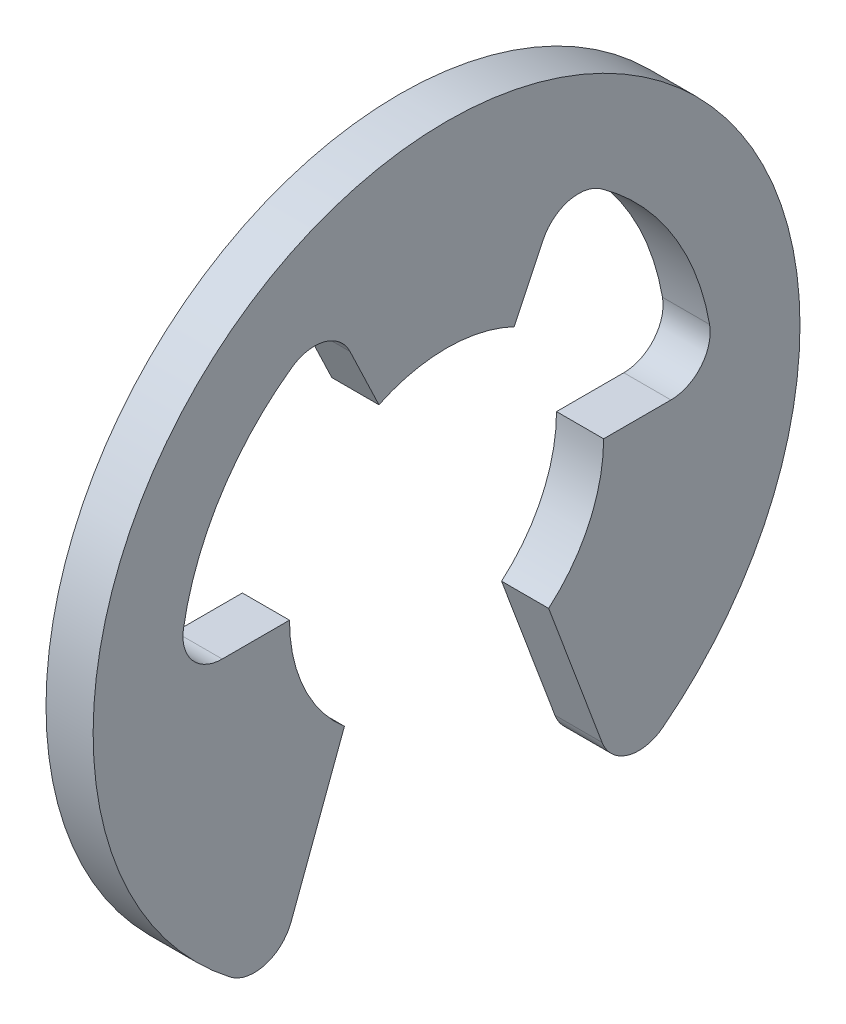
ISO-10303-21;
HEADER;
FILE_DESCRIPTION(('STEP AP214'),'2;1');
FILE_NAME('part.step','',(''),(''),'','','');
FILE_SCHEMA(('AUTOMOTIVE_DESIGN { 1 0 10303 214 1 1 1 1 }'));
ENDSEC;
DATA;
#1=APPLICATION_CONTEXT('core data for automotive mechanical design processes');
#2=APPLICATION_PROTOCOL_DEFINITION('international standard','automotive_design',2000,#1);
#3=PRODUCT_CONTEXT('',#1,'mechanical');
#4=PRODUCT('Part','Part','',(#3));
#5=PRODUCT_RELATED_PRODUCT_CATEGORY('part','',(#4));
#6=PRODUCT_DEFINITION_FORMATION('','',#4);
#7=PRODUCT_DEFINITION_CONTEXT('part definition',#1,'design');
#8=PRODUCT_DEFINITION('design','',#6,#7);
#9=PRODUCT_DEFINITION_SHAPE('','',#8);
#10=(LENGTH_UNIT() NAMED_UNIT(*) SI_UNIT(.MILLI.,.METRE.));
#11=(NAMED_UNIT(*) PLANE_ANGLE_UNIT() SI_UNIT($,.RADIAN.));
#12=(NAMED_UNIT(*) SI_UNIT($,.STERADIAN.) SOLID_ANGLE_UNIT());
#13=UNCERTAINTY_MEASURE_WITH_UNIT(LENGTH_MEASURE(1.E-05),#10,'distance_accuracy_value','');
#14=(GEOMETRIC_REPRESENTATION_CONTEXT(3) GLOBAL_UNCERTAINTY_ASSIGNED_CONTEXT((#13)) GLOBAL_UNIT_ASSIGNED_CONTEXT((#10,
#11,#12)) REPRESENTATION_CONTEXT('',''));
#15=CARTESIAN_POINT('',(0.,0.,0.));
#16=DIRECTION('',(0.,0.,1.));
#17=DIRECTION('',(1.,0.,0.));
#18=AXIS2_PLACEMENT_3D('',#15,#16,#17);
#19=CARTESIAN_POINT('',(0.6,0.500000000000001,-2.85657137141714));
#20=DIRECTION('',(-1.,0.,0.));
#21=DIRECTION('',(0.,0.,1.));
#22=AXIS2_PLACEMENT_3D('',#19,#20,#21);
#23=CYLINDRICAL_SURFACE('',#22,0.5);
#24=CARTESIAN_POINT('',(0.,0.500000000000001,-2.85657137141714));
#25=DIRECTION('',(-1.,0.,0.));
#26=DIRECTION('',(0.,0.,-1.));
#27=AXIS2_PLACEMENT_3D('',#24,#25,#26);
#28=CIRCLE('',#27,0.5);
#29=CARTESIAN_POINT('',(0.,0.586206896551725,-3.34908367683389));
#30=VERTEX_POINT('',#29);
#31=CARTESIAN_POINT('',(0.,0.,-2.85657137141714));
#32=VERTEX_POINT('',#31);
#33=EDGE_CURVE('E195',#30,#32,#28,.T.);
#34=ORIENTED_EDGE('',*,*,#33,.T.);
#35=DIRECTION('',(-1.,0.,0.));
#36=VECTOR('',#35,1.);
#37=CARTESIAN_POINT('',(0.6,0.,-2.85657137141714));
#38=LINE('',#37,#36);
#39=CARTESIAN_POINT('',(0.6,0.,-2.85657137141714));
#40=VERTEX_POINT('',#39);
#41=EDGE_CURVE('E11',#40,#32,#38,.T.);
#42=ORIENTED_EDGE('',*,*,#41,.F.);
#43=CARTESIAN_POINT('',(0.6,0.500000000000001,-2.85657137141714));
#44=DIRECTION('',(-1.,0.,0.));
#45=DIRECTION('',(0.,0.,-1.));
#46=AXIS2_PLACEMENT_3D('',#43,#44,#45);
#47=CIRCLE('',#46,0.5);
#48=CARTESIAN_POINT('',(0.6,0.586206896551725,-3.34908367683389));
#49=VERTEX_POINT('',#48);
#50=EDGE_CURVE('E229',#49,#40,#47,.T.);
#51=ORIENTED_EDGE('',*,*,#50,.F.);
#52=DIRECTION('',(-1.,0.,0.));
#53=VECTOR('',#52,1.);
#54=CARTESIAN_POINT('',(0.6,0.586206896551725,-3.34908367683389));
#55=LINE('',#54,#53);
#56=EDGE_CURVE('E191',#49,#30,#55,.T.);
#57=ORIENTED_EDGE('',*,*,#56,.T.);
#58=EDGE_LOOP('',(#34,#42,#51,#57));
#59=FACE_BOUND('',#58,.T.);
#60=ADVANCED_FACE('F39',(#59),#23,.F.);
#61=CARTESIAN_POINT('',(0.6,0.,-2.85657137141714));
#62=DIRECTION('',(0.,-1.,0.));
#63=DIRECTION('',(0.,0.,-1.));
#64=AXIS2_PLACEMENT_3D('',#61,#62,#63);
#65=PLANE('',#64);
#66=DIRECTION('',(0.,0.,1.));
#67=VECTOR('',#66,1.);
#68=CARTESIAN_POINT('',(0.,0.,-2.85657137141714));
#69=LINE('',#68,#67);
#70=CARTESIAN_POINT('',(0.,0.,-2.));
#71=VERTEX_POINT('',#70);
#72=EDGE_CURVE('E198',#32,#71,#69,.T.);
#73=ORIENTED_EDGE('',*,*,#72,.T.);
#74=DIRECTION('',(-1.,0.,0.));
#75=VECTOR('',#74,1.);
#76=CARTESIAN_POINT('',(0.6,0.,-2.));
#77=LINE('',#76,#75);
#78=CARTESIAN_POINT('',(0.6,0.,-2.));
#79=VERTEX_POINT('',#78);
#80=EDGE_CURVE('E47',#79,#71,#77,.T.);
#81=ORIENTED_EDGE('',*,*,#80,.F.);
#82=DIRECTION('',(0.,0.,1.));
#83=VECTOR('',#82,1.);
#84=CARTESIAN_POINT('',(0.6,0.,-2.85657137141714));
#85=LINE('',#84,#83);
#86=EDGE_CURVE('E128',#40,#79,#85,.T.);
#87=ORIENTED_EDGE('',*,*,#86,.F.);
#88=ORIENTED_EDGE('',*,*,#41,.T.);
#89=EDGE_LOOP('',(#73,#81,#87,#88));
#90=FACE_BOUND('',#89,.T.);
#91=ADVANCED_FACE('F337',(#90),#65,.F.);
#92=CARTESIAN_POINT('',(0.6,0.,0.));
#93=DIRECTION('',(-1.,0.,0.));
#94=DIRECTION('',(0.,0.,1.));
#95=AXIS2_PLACEMENT_3D('',#92,#93,#94);
#96=CYLINDRICAL_SURFACE('',#95,2.);
#97=CARTESIAN_POINT('',(0.,0.,0.));
#98=DIRECTION('',(-1.,0.,0.));
#99=DIRECTION('',(0.,0.,-1.));
#100=AXIS2_PLACEMENT_3D('',#97,#98,#99);
#101=CIRCLE('',#100,2.);
#102=CARTESIAN_POINT('',(0.,-1.51986841535707,-1.3));
#103=VERTEX_POINT('',#102);
#104=EDGE_CURVE('E200',#71,#103,#101,.T.);
#105=ORIENTED_EDGE('',*,*,#104,.T.);
#106=DIRECTION('',(-1.,0.,0.));
#107=VECTOR('',#106,1.);
#108=CARTESIAN_POINT('',(0.6,-1.51986841535707,-1.3));
#109=LINE('',#108,#107);
#110=CARTESIAN_POINT('',(0.6,-1.51986841535707,-1.3));
#111=VERTEX_POINT('',#110);
#112=EDGE_CURVE('E266',#111,#103,#109,.T.);
#113=ORIENTED_EDGE('',*,*,#112,.F.);
#114=CARTESIAN_POINT('',(0.6,0.,0.));
#115=DIRECTION('',(-1.,0.,0.));
#116=DIRECTION('',(0.,0.,-1.));
#117=AXIS2_PLACEMENT_3D('',#114,#115,#116);
#118=CIRCLE('',#117,2.);
#119=EDGE_CURVE('E274',#79,#111,#118,.T.);
#120=ORIENTED_EDGE('',*,*,#119,.F.);
#121=ORIENTED_EDGE('',*,*,#80,.T.);
#122=EDGE_LOOP('',(#105,#113,#120,#121));
#123=FACE_BOUND('',#122,.T.);
#124=ADVANCED_FACE('F272',(#123),#96,.F.);
#125=CARTESIAN_POINT('',(0.6,-1.51986841535707,-1.3));
#126=DIRECTION('',(0.,0.350207381259467,-0.936672189248398));
#127=DIRECTION('',(0.,0.936672189248398,0.350207381259467));
#128=AXIS2_PLACEMENT_3D('',#125,#126,#127);
#129=PLANE('',#128);
#130=DIRECTION('',(0.,-0.936672189248398,-0.350207381259466));
#131=VECTOR('',#130,1.);
#132=CARTESIAN_POINT('',(0.,-1.51986841535707,-1.3));
#133=LINE('',#132,#131);
#134=CARTESIAN_POINT('',(0.,-3.33835012725396,-1.97990245200155));
#135=VERTEX_POINT('',#134);
#136=EDGE_CURVE('E202',#103,#135,#133,.T.);
#137=ORIENTED_EDGE('',*,*,#136,.T.);
#138=DIRECTION('',(-1.,0.,0.));
#139=VECTOR('',#138,1.);
#140=CARTESIAN_POINT('',(0.6,-3.33835012725396,-1.97990245200155));
#141=LINE('',#140,#139);
#142=CARTESIAN_POINT('',(0.6,-3.33835012725396,-1.97990245200155));
#143=VERTEX_POINT('',#142);
#144=EDGE_CURVE('E263',#143,#135,#141,.T.);
#145=ORIENTED_EDGE('',*,*,#144,.F.);
#146=DIRECTION('',(0.,-0.936672189248398,-0.350207381259466));
#147=VECTOR('',#146,1.);
#148=CARTESIAN_POINT('',(0.6,-1.51986841535707,-1.3));
#149=LINE('',#148,#147);
#150=EDGE_CURVE('E292',#111,#143,#149,.T.);
#151=ORIENTED_EDGE('',*,*,#150,.F.);
#152=ORIENTED_EDGE('',*,*,#112,.T.);
#153=EDGE_LOOP('',(#137,#145,#151,#152));
#154=FACE_BOUND('',#153,.T.);
#155=ADVANCED_FACE('F283',(#154),#129,.F.);
#156=CARTESIAN_POINT('',(0.6,-3.16324643662422,-2.44823854662575));
#157=DIRECTION('',(-1.,0.,0.));
#158=DIRECTION('',(0.,0.,1.));
#159=AXIS2_PLACEMENT_3D('',#156,#157,#158);
#160=CYLINDRICAL_SURFACE('',#159,0.500000000000001);
#161=CARTESIAN_POINT('',(0.,-3.16324643662422,-2.44823854662575));
#162=DIRECTION('',(1.,0.,0.));
#163=DIRECTION('',(0.,0.,-1.));
#164=AXIS2_PLACEMENT_3D('',#161,#162,#163);
#165=CIRCLE('',#164,0.500000000000001);
#166=CARTESIAN_POINT('',(0.,-3.55865224120225,-2.75426836495397));
#167=VERTEX_POINT('',#166);
#168=EDGE_CURVE('E204',#135,#167,#165,.T.);
#169=ORIENTED_EDGE('',*,*,#168,.T.);
#170=DIRECTION('',(-1.,0.,0.));
#171=VECTOR('',#170,1.);
#172=CARTESIAN_POINT('',(0.6,-3.55865224120225,-2.75426836495397));
#173=LINE('',#172,#171);
#174=CARTESIAN_POINT('',(0.6,-3.55865224120225,-2.75426836495397));
#175=VERTEX_POINT('',#174);
#176=EDGE_CURVE('E260',#175,#167,#173,.T.);
#177=ORIENTED_EDGE('',*,*,#176,.F.);
#178=CARTESIAN_POINT('',(0.6,-3.16324643662422,-2.44823854662575));
#179=DIRECTION('',(1.,0.,0.));
#180=DIRECTION('',(0.,0.,-1.));
#181=AXIS2_PLACEMENT_3D('',#178,#179,#180);
#182=CIRCLE('',#181,0.500000000000001);
#183=EDGE_CURVE('E289',#143,#175,#182,.T.);
#184=ORIENTED_EDGE('',*,*,#183,.F.);
#185=ORIENTED_EDGE('',*,*,#144,.T.);
#186=EDGE_LOOP('',(#169,#177,#184,#185));
#187=FACE_BOUND('',#186,.T.);
#188=ADVANCED_FACE('F287',(#187),#160,.T.);
#189=CARTESIAN_POINT('',(0.6,0.,0.));
#190=DIRECTION('',(-1.,0.,0.));
#191=DIRECTION('',(0.,0.,1.));
#192=AXIS2_PLACEMENT_3D('',#189,#190,#191);
#193=CYLINDRICAL_SURFACE('',#192,4.5);
#194=CARTESIAN_POINT('',(0.,0.,0.));
#195=DIRECTION('',(1.,0.,0.));
#196=DIRECTION('',(0.,0.,-1.));
#197=AXIS2_PLACEMENT_3D('',#194,#195,#196);
#198=CIRCLE('',#197,4.5);
#199=CARTESIAN_POINT('',(0.,-3.55865224120225,2.75426836495396));
#200=VERTEX_POINT('',#199);
#201=EDGE_CURVE('E206',#167,#200,#198,.T.);
#202=ORIENTED_EDGE('',*,*,#201,.T.);
#203=DIRECTION('',(-1.,0.,0.));
#204=VECTOR('',#203,1.);
#205=CARTESIAN_POINT('',(0.6,-3.55865224120225,2.75426836495396));
#206=LINE('',#205,#204);
#207=CARTESIAN_POINT('',(0.6,-3.55865224120225,2.75426836495396));
#208=VERTEX_POINT('',#207);
#209=EDGE_CURVE('E257',#208,#200,#206,.T.);
#210=ORIENTED_EDGE('',*,*,#209,.F.);
#211=CARTESIAN_POINT('',(0.6,0.,0.));
#212=DIRECTION('',(1.,0.,0.));
#213=DIRECTION('',(0.,0.,-1.));
#214=AXIS2_PLACEMENT_3D('',#211,#212,#213);
#215=CIRCLE('',#214,4.5);
#216=EDGE_CURVE('E291',#175,#208,#215,.T.);
#217=ORIENTED_EDGE('',*,*,#216,.F.);
#218=ORIENTED_EDGE('',*,*,#176,.T.);
#219=EDGE_LOOP('',(#202,#210,#217,#218));
#220=FACE_BOUND('',#219,.T.);
#221=ADVANCED_FACE('F350',(#220),#193,.T.);
#222=CARTESIAN_POINT('',(0.6,-3.16324643662422,2.44823854662575));
#223=DIRECTION('',(-1.,0.,0.));
#224=DIRECTION('',(0.,0.,1.));
#225=AXIS2_PLACEMENT_3D('',#222,#223,#224);
#226=CYLINDRICAL_SURFACE('',#225,0.5);
#227=CARTESIAN_POINT('',(0.,-3.16324643662422,2.44823854662575));
#228=DIRECTION('',(1.,0.,0.));
#229=DIRECTION('',(0.,0.,-1.));
#230=AXIS2_PLACEMENT_3D('',#227,#228,#229);
#231=CIRCLE('',#230,0.5);
#232=CARTESIAN_POINT('',(0.,-3.33835012725396,1.97990245200155));
#233=VERTEX_POINT('',#232);
#234=EDGE_CURVE('E208',#200,#233,#231,.T.);
#235=ORIENTED_EDGE('',*,*,#234,.T.);
#236=DIRECTION('',(-1.,0.,0.));
#237=VECTOR('',#236,1.);
#238=CARTESIAN_POINT('',(0.6,-3.33835012725396,1.97990245200155));
#239=LINE('',#238,#237);
#240=CARTESIAN_POINT('',(0.6,-3.33835012725396,1.97990245200155));
#241=VERTEX_POINT('',#240);
#242=EDGE_CURVE('E254',#241,#233,#239,.T.);
#243=ORIENTED_EDGE('',*,*,#242,.F.);
#244=CARTESIAN_POINT('',(0.6,-3.16324643662422,2.44823854662575));
#245=DIRECTION('',(1.,0.,0.));
#246=DIRECTION('',(0.,0.,-1.));
#247=AXIS2_PLACEMENT_3D('',#244,#245,#246);
#248=CIRCLE('',#247,0.5);
#249=EDGE_CURVE('E294',#208,#241,#248,.T.);
#250=ORIENTED_EDGE('',*,*,#249,.F.);
#251=ORIENTED_EDGE('',*,*,#209,.T.);
#252=EDGE_LOOP('',(#235,#243,#250,#251));
#253=FACE_BOUND('',#252,.T.);
#254=ADVANCED_FACE('F353',(#253),#226,.T.);
#255=CARTESIAN_POINT('',(0.6,-3.33835012725396,1.97990245200155));
#256=DIRECTION('',(0.,0.350207381259465,0.936672189248399));
#257=DIRECTION('',(0.,-0.936672189248399,0.350207381259465));
#258=AXIS2_PLACEMENT_3D('',#255,#256,#257);
#259=PLANE('',#258);
#260=DIRECTION('',(0.,0.936672189248398,-0.350207381259465));
#261=VECTOR('',#260,1.);
#262=CARTESIAN_POINT('',(0.,-3.33835012725396,1.97990245200155));
#263=LINE('',#262,#261);
#264=CARTESIAN_POINT('',(0.,-1.51986841535706,1.3));
#265=VERTEX_POINT('',#264);
#266=EDGE_CURVE('E210',#233,#265,#263,.T.);
#267=ORIENTED_EDGE('',*,*,#266,.T.);
#268=DIRECTION('',(-1.,0.,0.));
#269=VECTOR('',#268,1.);
#270=CARTESIAN_POINT('',(0.6,-1.51986841535706,1.3));
#271=LINE('',#270,#269);
#272=CARTESIAN_POINT('',(0.6,-1.51986841535706,1.3));
#273=VERTEX_POINT('',#272);
#274=EDGE_CURVE('E251',#273,#265,#271,.T.);
#275=ORIENTED_EDGE('',*,*,#274,.F.);
#276=DIRECTION('',(0.,0.936672189248398,-0.350207381259465));
#277=VECTOR('',#276,1.);
#278=CARTESIAN_POINT('',(0.6,-3.33835012725396,1.97990245200155));
#279=LINE('',#278,#277);
#280=EDGE_CURVE('E300',#241,#273,#279,.T.);
#281=ORIENTED_EDGE('',*,*,#280,.F.);
#282=ORIENTED_EDGE('',*,*,#242,.T.);
#283=EDGE_LOOP('',(#267,#275,#281,#282));
#284=FACE_BOUND('',#283,.T.);
#285=ADVANCED_FACE('F357',(#284),#259,.F.);
#286=CARTESIAN_POINT('',(0.6,0.,0.));
#287=DIRECTION('',(-1.,0.,0.));
#288=DIRECTION('',(0.,0.,1.));
#289=AXIS2_PLACEMENT_3D('',#286,#287,#288);
#290=CYLINDRICAL_SURFACE('',#289,2.);
#291=CARTESIAN_POINT('',(0.,0.,0.));
#292=DIRECTION('',(-1.,0.,0.));
#293=DIRECTION('',(0.,0.,-1.));
#294=AXIS2_PLACEMENT_3D('',#291,#292,#293);
#295=CIRCLE('',#294,2.);
#296=CARTESIAN_POINT('',(0.,0.,2.));
#297=VERTEX_POINT('',#296);
#298=EDGE_CURVE('E212',#265,#297,#295,.T.);
#299=ORIENTED_EDGE('',*,*,#298,.T.);
#300=DIRECTION('',(-1.,0.,0.));
#301=VECTOR('',#300,1.);
#302=CARTESIAN_POINT('',(0.6,0.,2.));
#303=LINE('',#302,#301);
#304=CARTESIAN_POINT('',(0.6,0.,2.));
#305=VERTEX_POINT('',#304);
#306=EDGE_CURVE('E248',#305,#297,#303,.T.);
#307=ORIENTED_EDGE('',*,*,#306,.F.);
#308=CARTESIAN_POINT('',(0.6,0.,0.));
#309=DIRECTION('',(-1.,0.,0.));
#310=DIRECTION('',(0.,0.,-1.));
#311=AXIS2_PLACEMENT_3D('',#308,#309,#310);
#312=CIRCLE('',#311,2.);
#313=EDGE_CURVE('E302',#273,#305,#312,.T.);
#314=ORIENTED_EDGE('',*,*,#313,.F.);
#315=ORIENTED_EDGE('',*,*,#274,.T.);
#316=EDGE_LOOP('',(#299,#307,#314,#315));
#317=FACE_BOUND('',#316,.T.);
#318=ADVANCED_FACE('F361',(#317),#290,.F.);
#319=CARTESIAN_POINT('',(0.6,0.,2.));
#320=DIRECTION('',(0.,-1.,0.));
#321=DIRECTION('',(0.,0.,-1.));
#322=AXIS2_PLACEMENT_3D('',#319,#320,#321);
#323=PLANE('',#322);
#324=DIRECTION('',(0.,0.,1.));
#325=VECTOR('',#324,1.);
#326=CARTESIAN_POINT('',(0.,0.,2.));
#327=LINE('',#326,#325);
#328=CARTESIAN_POINT('',(0.,0.,2.85657137141714));
#329=VERTEX_POINT('',#328);
#330=EDGE_CURVE('E214',#297,#329,#327,.T.);
#331=ORIENTED_EDGE('',*,*,#330,.T.);
#332=DIRECTION('',(-1.,0.,0.));
#333=VECTOR('',#332,1.);
#334=CARTESIAN_POINT('',(0.6,0.,2.85657137141714));
#335=LINE('',#334,#333);
#336=CARTESIAN_POINT('',(0.6,0.,2.85657137141714));
#337=VERTEX_POINT('',#336);
#338=EDGE_CURVE('E245',#337,#329,#335,.T.);
#339=ORIENTED_EDGE('',*,*,#338,.F.);
#340=DIRECTION('',(0.,0.,1.));
#341=VECTOR('',#340,1.);
#342=CARTESIAN_POINT('',(0.6,0.,2.));
#343=LINE('',#342,#341);
#344=EDGE_CURVE('E304',#305,#337,#343,.T.);
#345=ORIENTED_EDGE('',*,*,#344,.F.);
#346=ORIENTED_EDGE('',*,*,#306,.T.);
#347=EDGE_LOOP('',(#331,#339,#345,#346));
#348=FACE_BOUND('',#347,.T.);
#349=ADVANCED_FACE('F365',(#348),#323,.F.);
#350=CARTESIAN_POINT('',(0.6,0.5,2.85657137141714));
#351=DIRECTION('',(-1.,0.,0.));
#352=DIRECTION('',(0.,0.,1.));
#353=AXIS2_PLACEMENT_3D('',#350,#351,#352);
#354=CYLINDRICAL_SURFACE('',#353,0.5);
#355=CARTESIAN_POINT('',(0.,0.5,2.85657137141714));
#356=DIRECTION('',(-1.,0.,0.));
#357=DIRECTION('',(0.,0.,-1.));
#358=AXIS2_PLACEMENT_3D('',#355,#356,#357);
#359=CIRCLE('',#358,0.5);
#360=CARTESIAN_POINT('',(0.,0.586206896551724,3.34908367683389));
#361=VERTEX_POINT('',#360);
#362=EDGE_CURVE('E216',#329,#361,#359,.T.);
#363=ORIENTED_EDGE('',*,*,#362,.T.);
#364=DIRECTION('',(-1.,0.,0.));
#365=VECTOR('',#364,1.);
#366=CARTESIAN_POINT('',(0.6,0.586206896551724,3.34908367683389));
#367=LINE('',#366,#365);
#368=CARTESIAN_POINT('',(0.6,0.586206896551724,3.34908367683389));
#369=VERTEX_POINT('',#368);
#370=EDGE_CURVE('E242',#369,#361,#367,.T.);
#371=ORIENTED_EDGE('',*,*,#370,.F.);
#372=CARTESIAN_POINT('',(0.6,0.5,2.85657137141714));
#373=DIRECTION('',(-1.,0.,0.));
#374=DIRECTION('',(0.,0.,-1.));
#375=AXIS2_PLACEMENT_3D('',#372,#373,#374);
#376=CIRCLE('',#375,0.5);
#377=EDGE_CURVE('E306',#337,#369,#376,.T.);
#378=ORIENTED_EDGE('',*,*,#377,.F.);
#379=ORIENTED_EDGE('',*,*,#338,.T.);
#380=EDGE_LOOP('',(#363,#371,#378,#379));
#381=FACE_BOUND('',#380,.T.);
#382=ADVANCED_FACE('F369',(#381),#354,.F.);
#383=CARTESIAN_POINT('',(0.6,0.,0.));
#384=DIRECTION('',(-1.,0.,0.));
#385=DIRECTION('',(0.,0.,1.));
#386=AXIS2_PLACEMENT_3D('',#383,#384,#385);
#387=CYLINDRICAL_SURFACE('',#386,3.4);
#388=CARTESIAN_POINT('',(0.,0.,0.));
#389=DIRECTION('',(-1.,0.,0.));
#390=DIRECTION('',(0.,0.,-1.));
#391=AXIS2_PLACEMENT_3D('',#388,#389,#390);
#392=CIRCLE('',#391,3.4);
#393=CARTESIAN_POINT('',(0.,2.77046506877553,1.97091940542849));
#394=VERTEX_POINT('',#393);
#395=EDGE_CURVE('E218',#361,#394,#392,.T.);
#396=ORIENTED_EDGE('',*,*,#395,.T.);
#397=DIRECTION('',(-1.,0.,0.));
#398=VECTOR('',#397,1.);
#399=CARTESIAN_POINT('',(0.6,2.77046506877553,1.97091940542849));
#400=LINE('',#399,#398);
#401=CARTESIAN_POINT('',(0.6,2.77046506877553,1.97091940542849));
#402=VERTEX_POINT('',#401);
#403=EDGE_CURVE('E239',#402,#394,#400,.T.);
#404=ORIENTED_EDGE('',*,*,#403,.F.);
#405=CARTESIAN_POINT('',(0.6,0.,0.));
#406=DIRECTION('',(-1.,0.,0.));
#407=DIRECTION('',(0.,0.,-1.));
#408=AXIS2_PLACEMENT_3D('',#405,#406,#407);
#409=CIRCLE('',#408,3.4);
#410=EDGE_CURVE('E308',#369,#402,#409,.T.);
#411=ORIENTED_EDGE('',*,*,#410,.F.);
#412=ORIENTED_EDGE('',*,*,#370,.T.);
#413=EDGE_LOOP('',(#396,#404,#411,#412));
#414=FACE_BOUND('',#413,.T.);
#415=ADVANCED_FACE('F373',(#414),#387,.F.);
#416=CARTESIAN_POINT('',(0.6,2.36304373513207,1.68107831639489));
#417=DIRECTION('',(-1.,0.,0.));
#418=DIRECTION('',(0.,0.,1.));
#419=AXIS2_PLACEMENT_3D('',#416,#417,#418);
#420=CYLINDRICAL_SURFACE('',#419,0.500000000000001);
#421=CARTESIAN_POINT('',(0.,2.36304373513207,1.68107831639489));
#422=DIRECTION('',(-1.,0.,0.));
#423=DIRECTION('',(0.,0.,-1.));
#424=AXIS2_PLACEMENT_3D('',#421,#422,#423);
#425=CIRCLE('',#424,0.500000000000001);
#426=CARTESIAN_POINT('',(0.,2.57829928353621,1.22978567421996));
#427=VERTEX_POINT('',#426);
#428=EDGE_CURVE('E220',#394,#427,#425,.T.);
#429=ORIENTED_EDGE('',*,*,#428,.T.);
#430=DIRECTION('',(-1.,0.,0.));
#431=VECTOR('',#430,1.);
#432=CARTESIAN_POINT('',(0.6,2.57829928353621,1.22978567421996));
#433=LINE('',#432,#431);
#434=CARTESIAN_POINT('',(0.6,2.57829928353621,1.22978567421996));
#435=VERTEX_POINT('',#434);
#436=EDGE_CURVE('E236',#435,#427,#433,.T.);
#437=ORIENTED_EDGE('',*,*,#436,.F.);
#438=CARTESIAN_POINT('',(0.6,2.36304373513207,1.68107831639489));
#439=DIRECTION('',(-1.,0.,0.));
#440=DIRECTION('',(0.,0.,-1.));
#441=AXIS2_PLACEMENT_3D('',#438,#439,#440);
#442=CIRCLE('',#441,0.500000000000001);
#443=EDGE_CURVE('E310',#402,#435,#442,.T.);
#444=ORIENTED_EDGE('',*,*,#443,.F.);
#445=ORIENTED_EDGE('',*,*,#403,.T.);
#446=EDGE_LOOP('',(#429,#437,#444,#445));
#447=FACE_BOUND('',#446,.T.);
#448=ADVANCED_FACE('F377',(#447),#420,.F.);
#449=CARTESIAN_POINT('',(0.6,2.57829928353621,1.22978567421996));
#450=DIRECTION('',(0.,0.430511096808291,-0.902585284349863));
#451=DIRECTION('',(0.,0.902585284349863,0.430511096808291));
#452=AXIS2_PLACEMENT_3D('',#449,#450,#451);
#453=PLANE('',#452);
#454=DIRECTION('',(0.,-0.902585284349863,-0.430511096808291));
#455=VECTOR('',#454,1.);
#456=CARTESIAN_POINT('',(0.,2.57829928353621,1.22978567421996));
#457=LINE('',#456,#455);
#458=CARTESIAN_POINT('',(0.,1.80517056869972,0.861022193616585));
#459=VERTEX_POINT('',#458);
#460=EDGE_CURVE('E222',#427,#459,#457,.T.);
#461=ORIENTED_EDGE('',*,*,#460,.T.);
#462=DIRECTION('',(-1.,0.,0.));
#463=VECTOR('',#462,1.);
#464=CARTESIAN_POINT('',(0.6,1.80517056869972,0.861022193616585));
#465=LINE('',#464,#463);
#466=CARTESIAN_POINT('',(0.6,1.80517056869972,0.861022193616585));
#467=VERTEX_POINT('',#466);
#468=EDGE_CURVE('E233',#467,#459,#465,.T.);
#469=ORIENTED_EDGE('',*,*,#468,.F.);
#470=DIRECTION('',(0.,-0.902585284349863,-0.430511096808291));
#471=VECTOR('',#470,1.);
#472=CARTESIAN_POINT('',(0.6,2.57829928353621,1.22978567421996));
#473=LINE('',#472,#471);
#474=EDGE_CURVE('E312',#435,#467,#473,.T.);
#475=ORIENTED_EDGE('',*,*,#474,.F.);
#476=ORIENTED_EDGE('',*,*,#436,.T.);
#477=EDGE_LOOP('',(#461,#469,#475,#476));
#478=FACE_BOUND('',#477,.T.);
#479=ADVANCED_FACE('F318',(#478),#453,.F.);
#480=CARTESIAN_POINT('',(0.6,0.,0.));
#481=DIRECTION('',(-1.,0.,0.));
#482=DIRECTION('',(0.,0.,1.));
#483=AXIS2_PLACEMENT_3D('',#480,#481,#482);
#484=CYLINDRICAL_SURFACE('',#483,2.);
#485=CARTESIAN_POINT('',(0.,0.,0.));
#486=DIRECTION('',(-1.,0.,0.));
#487=DIRECTION('',(0.,0.,-1.));
#488=AXIS2_PLACEMENT_3D('',#485,#486,#487);
#489=CIRCLE('',#488,2.);
#490=CARTESIAN_POINT('',(0.,1.80517056869972,-0.861022193616582));
#491=VERTEX_POINT('',#490);
#492=EDGE_CURVE('E224',#459,#491,#489,.T.);
#493=ORIENTED_EDGE('',*,*,#492,.T.);
#494=DIRECTION('',(-1.,0.,0.));
#495=VECTOR('',#494,1.);
#496=CARTESIAN_POINT('',(0.6,1.80517056869972,-0.861022193616582));
#497=LINE('',#496,#495);
#498=CARTESIAN_POINT('',(0.6,1.80517056869972,-0.861022193616582));
#499=VERTEX_POINT('',#498);
#500=EDGE_CURVE('E186',#499,#491,#497,.T.);
#501=ORIENTED_EDGE('',*,*,#500,.F.);
#502=CARTESIAN_POINT('',(0.6,0.,0.));
#503=DIRECTION('',(-1.,0.,0.));
#504=DIRECTION('',(0.,0.,-1.));
#505=AXIS2_PLACEMENT_3D('',#502,#503,#504);
#506=CIRCLE('',#505,2.);
#507=EDGE_CURVE('E177',#467,#499,#506,.T.);
#508=ORIENTED_EDGE('',*,*,#507,.F.);
#509=ORIENTED_EDGE('',*,*,#468,.T.);
#510=EDGE_LOOP('',(#493,#501,#508,#509));
#511=FACE_BOUND('',#510,.T.);
#512=ADVANCED_FACE('F322',(#511),#484,.F.);
#513=CARTESIAN_POINT('',(0.6,1.80517056869973,-0.861022193616582));
#514=DIRECTION('',(0.,0.430511096808291,0.902585284349862));
#515=DIRECTION('',(0.,-0.902585284349862,0.430511096808291));
#516=AXIS2_PLACEMENT_3D('',#513,#514,#515);
#517=PLANE('',#516);
#518=DIRECTION('',(0.,0.902585284349862,-0.430511096808291));
#519=VECTOR('',#518,1.);
#520=CARTESIAN_POINT('',(0.,1.80517056869973,-0.861022193616582));
#521=LINE('',#520,#519);
#522=CARTESIAN_POINT('',(0.,2.57829928353622,-1.22978567421996));
#523=VERTEX_POINT('',#522);
#524=EDGE_CURVE('E185',#491,#523,#521,.T.);
#525=ORIENTED_EDGE('',*,*,#524,.T.);
#526=DIRECTION('',(-1.,0.,0.));
#527=VECTOR('',#526,1.);
#528=CARTESIAN_POINT('',(0.6,2.57829928353622,-1.22978567421996));
#529=LINE('',#528,#527);
#530=CARTESIAN_POINT('',(0.6,2.57829928353622,-1.22978567421996));
#531=VERTEX_POINT('',#530);
#532=EDGE_CURVE('E182',#531,#523,#529,.T.);
#533=ORIENTED_EDGE('',*,*,#532,.F.);
#534=DIRECTION('',(0.,0.902585284349862,-0.430511096808291));
#535=VECTOR('',#534,1.);
#536=CARTESIAN_POINT('',(0.6,1.80517056869973,-0.861022193616582));
#537=LINE('',#536,#535);
#538=EDGE_CURVE('E171',#499,#531,#537,.T.);
#539=ORIENTED_EDGE('',*,*,#538,.F.);
#540=ORIENTED_EDGE('',*,*,#500,.T.);
#541=EDGE_LOOP('',(#525,#533,#539,#540));
#542=FACE_BOUND('',#541,.T.);
#543=ADVANCED_FACE('F183',(#542),#517,.F.);
#544=CARTESIAN_POINT('',(0.6,2.36304373513207,-1.68107831639489));
#545=DIRECTION('',(-1.,0.,0.));
#546=DIRECTION('',(0.,0.,1.));
#547=AXIS2_PLACEMENT_3D('',#544,#545,#546);
#548=CYLINDRICAL_SURFACE('',#547,0.5);
#549=CARTESIAN_POINT('',(0.,2.36304373513207,-1.68107831639489));
#550=DIRECTION('',(-1.,0.,0.));
#551=DIRECTION('',(0.,0.,-1.));
#552=AXIS2_PLACEMENT_3D('',#549,#550,#551);
#553=CIRCLE('',#552,0.5);
#554=CARTESIAN_POINT('',(0.,2.77046506877553,-1.97091940542849));
#555=VERTEX_POINT('',#554);
#556=EDGE_CURVE('E114',#523,#555,#553,.T.);
#557=ORIENTED_EDGE('',*,*,#556,.T.);
#558=DIRECTION('',(-1.,0.,0.));
#559=VECTOR('',#558,1.);
#560=CARTESIAN_POINT('',(0.6,2.77046506877553,-1.97091940542849));
#561=LINE('',#560,#559);
#562=CARTESIAN_POINT('',(0.6,2.77046506877553,-1.97091940542849));
#563=VERTEX_POINT('',#562);
#564=EDGE_CURVE('E187',#563,#555,#561,.T.);
#565=ORIENTED_EDGE('',*,*,#564,.F.);
#566=CARTESIAN_POINT('',(0.6,2.36304373513207,-1.68107831639489));
#567=DIRECTION('',(-1.,0.,0.));
#568=DIRECTION('',(0.,0.,-1.));
#569=AXIS2_PLACEMENT_3D('',#566,#567,#568);
#570=CIRCLE('',#569,0.5);
#571=EDGE_CURVE('E175',#531,#563,#570,.T.);
#572=ORIENTED_EDGE('',*,*,#571,.F.);
#573=ORIENTED_EDGE('',*,*,#532,.T.);
#574=EDGE_LOOP('',(#557,#565,#572,#573));
#575=FACE_BOUND('',#574,.T.);
#576=ADVANCED_FACE('F189',(#575),#548,.F.);
#577=CARTESIAN_POINT('',(0.6,0.,0.));
#578=DIRECTION('',(-1.,0.,0.));
#579=DIRECTION('',(0.,0.,1.));
#580=AXIS2_PLACEMENT_3D('',#577,#578,#579);
#581=CYLINDRICAL_SURFACE('',#580,3.4);
#582=CARTESIAN_POINT('',(0.,0.,0.));
#583=DIRECTION('',(-1.,0.,0.));
#584=DIRECTION('',(0.,0.,-1.));
#585=AXIS2_PLACEMENT_3D('',#582,#583,#584);
#586=CIRCLE('',#585,3.4);
#587=EDGE_CURVE('E120',#555,#30,#586,.T.);
#588=ORIENTED_EDGE('',*,*,#587,.T.);
#589=ORIENTED_EDGE('',*,*,#56,.F.);
#590=CARTESIAN_POINT('',(0.6,0.,0.));
#591=DIRECTION('',(-1.,0.,0.));
#592=DIRECTION('',(0.,0.,-1.));
#593=AXIS2_PLACEMENT_3D('',#590,#591,#592);
#594=CIRCLE('',#593,3.4);
#595=EDGE_CURVE('E55',#563,#49,#594,.T.);
#596=ORIENTED_EDGE('',*,*,#595,.F.);
#597=ORIENTED_EDGE('',*,*,#564,.T.);
#598=EDGE_LOOP('',(#588,#589,#596,#597));
#599=FACE_BOUND('',#598,.T.);
#600=ADVANCED_FACE('F326',(#599),#581,.F.);
#601=CARTESIAN_POINT('',(0.6,0.500000000000001,-2.85657137141714));
#602=DIRECTION('',(1.,0.,0.));
#603=DIRECTION('',(0.,0.,-1.));
#604=AXIS2_PLACEMENT_3D('',#601,#602,#603);
#605=PLANE('',#604);
#606=ORIENTED_EDGE('',*,*,#50,.T.);
#607=ORIENTED_EDGE('',*,*,#86,.T.);
#608=ORIENTED_EDGE('',*,*,#119,.T.);
#609=ORIENTED_EDGE('',*,*,#150,.T.);
#610=ORIENTED_EDGE('',*,*,#183,.T.);
#611=ORIENTED_EDGE('',*,*,#216,.T.);
#612=ORIENTED_EDGE('',*,*,#249,.T.);
#613=ORIENTED_EDGE('',*,*,#280,.T.);
#614=ORIENTED_EDGE('',*,*,#313,.T.);
#615=ORIENTED_EDGE('',*,*,#344,.T.);
#616=ORIENTED_EDGE('',*,*,#377,.T.);
#617=ORIENTED_EDGE('',*,*,#410,.T.);
#618=ORIENTED_EDGE('',*,*,#443,.T.);
#619=ORIENTED_EDGE('',*,*,#474,.T.);
#620=ORIENTED_EDGE('',*,*,#507,.T.);
#621=ORIENTED_EDGE('',*,*,#538,.T.);
#622=ORIENTED_EDGE('',*,*,#571,.T.);
#623=ORIENTED_EDGE('',*,*,#595,.T.);
#624=EDGE_LOOP('',(#606,#607,#608,#609,#610,#611,#612,#613,#614,#615,#616,#617,#618,#619,#620,
#621,#622,#623));
#625=FACE_BOUND('',#624,.T.);
#626=ADVANCED_FACE('F173',(#625),#605,.T.);
#627=CARTESIAN_POINT('',(0.,0.500000000000001,-2.85657137141714));
#628=DIRECTION('',(1.,0.,0.));
#629=DIRECTION('',(0.,0.,-1.));
#630=AXIS2_PLACEMENT_3D('',#627,#628,#629);
#631=PLANE('',#630);
#632=ORIENTED_EDGE('',*,*,#33,.F.);
#633=ORIENTED_EDGE('',*,*,#587,.F.);
#634=ORIENTED_EDGE('',*,*,#556,.F.);
#635=ORIENTED_EDGE('',*,*,#524,.F.);
#636=ORIENTED_EDGE('',*,*,#492,.F.);
#637=ORIENTED_EDGE('',*,*,#460,.F.);
#638=ORIENTED_EDGE('',*,*,#428,.F.);
#639=ORIENTED_EDGE('',*,*,#395,.F.);
#640=ORIENTED_EDGE('',*,*,#362,.F.);
#641=ORIENTED_EDGE('',*,*,#330,.F.);
#642=ORIENTED_EDGE('',*,*,#298,.F.);
#643=ORIENTED_EDGE('',*,*,#266,.F.);
#644=ORIENTED_EDGE('',*,*,#234,.F.);
#645=ORIENTED_EDGE('',*,*,#201,.F.);
#646=ORIENTED_EDGE('',*,*,#168,.F.);
#647=ORIENTED_EDGE('',*,*,#136,.F.);
#648=ORIENTED_EDGE('',*,*,#104,.F.);
#649=ORIENTED_EDGE('',*,*,#72,.F.);
#650=EDGE_LOOP('',(#632,#633,#634,#635,#636,#637,#638,#639,#640,#641,#642,#643,#644,#645,#646,
#647,#648,#649));
#651=FACE_BOUND('',#650,.T.);
#652=ADVANCED_FACE('F278',(#651),#631,.F.);
#653=CLOSED_SHELL('',(#60,#91,#124,#155,#188,#221,#254,#285,#318,#349,#382,#415,#448,#479,#512,
#543,#576,#600,#626,#652));
#654=MANIFOLD_SOLID_BREP('B2',#653);
#655=ADVANCED_BREP_SHAPE_REPRESENTATION('',(#18,#654),#14);
#656=SHAPE_DEFINITION_REPRESENTATION(#9,#655);
ENDSEC;
END-ISO-10303-21;
